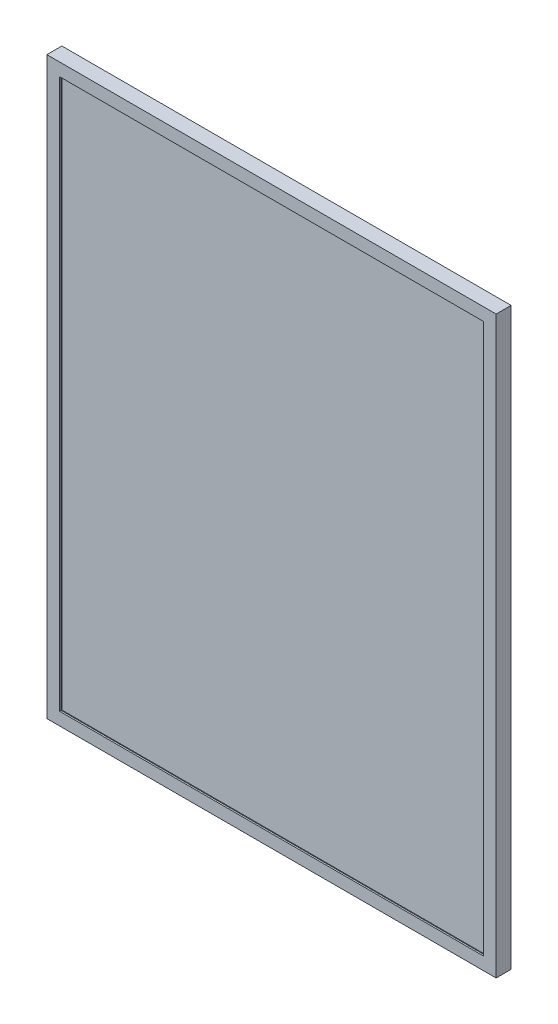
ISO-10303-21;
HEADER;
FILE_DESCRIPTION(('STEP AP214'),'2;1');
FILE_NAME('part.step','',(''),(''),'','','');
FILE_SCHEMA(('AUTOMOTIVE_DESIGN { 1 0 10303 214 1 1 1 1 }'));
ENDSEC;
DATA;
#1=APPLICATION_CONTEXT('core data for automotive mechanical design processes');
#2=APPLICATION_PROTOCOL_DEFINITION('international standard','automotive_design',2000,#1);
#3=PRODUCT_CONTEXT('',#1,'mechanical');
#4=PRODUCT('Part','Part','',(#3));
#5=PRODUCT_RELATED_PRODUCT_CATEGORY('part','',(#4));
#6=PRODUCT_DEFINITION_FORMATION('','',#4);
#7=PRODUCT_DEFINITION_CONTEXT('part definition',#1,'design');
#8=PRODUCT_DEFINITION('design','',#6,#7);
#9=PRODUCT_DEFINITION_SHAPE('','',#8);
#10=(LENGTH_UNIT() NAMED_UNIT(*) SI_UNIT(.MILLI.,.METRE.));
#11=(NAMED_UNIT(*) PLANE_ANGLE_UNIT() SI_UNIT($,.RADIAN.));
#12=(NAMED_UNIT(*) SI_UNIT($,.STERADIAN.) SOLID_ANGLE_UNIT());
#13=UNCERTAINTY_MEASURE_WITH_UNIT(LENGTH_MEASURE(1.E-05),#10,'distance_accuracy_value','');
#14=(GEOMETRIC_REPRESENTATION_CONTEXT(3) GLOBAL_UNCERTAINTY_ASSIGNED_CONTEXT((#13)) GLOBAL_UNIT_ASSIGNED_CONTEXT((#10,
#11,#12)) REPRESENTATION_CONTEXT('',''));
#15=CARTESIAN_POINT('',(0.,0.,0.));
#16=DIRECTION('',(0.,0.,1.));
#17=DIRECTION('',(1.,0.,0.));
#18=AXIS2_PLACEMENT_3D('',#15,#16,#17);
#19=CARTESIAN_POINT('',(-300.,-384.,20.));
#20=DIRECTION('',(1.,0.,0.));
#21=DIRECTION('',(0.,0.,-1.));
#22=AXIS2_PLACEMENT_3D('',#19,#20,#21);
#23=PLANE('',#22);
#24=DIRECTION('',(0.,-1.,0.));
#25=VECTOR('',#24,1.);
#26=CARTESIAN_POINT('',(-300.,-384.,0.));
#27=LINE('',#26,#25);
#28=CARTESIAN_POINT('',(-300.,384.,0.));
#29=VERTEX_POINT('',#28);
#30=CARTESIAN_POINT('',(-300.,-384.,0.));
#31=VERTEX_POINT('',#30);
#32=EDGE_CURVE('E212',#29,#31,#27,.T.);
#33=ORIENTED_EDGE('',*,*,#32,.T.);
#34=DIRECTION('',(0.,0.,-1.));
#35=VECTOR('',#34,1.);
#36=CARTESIAN_POINT('',(-300.,-384.,20.));
#37=LINE('',#36,#35);
#38=CARTESIAN_POINT('',(-300.,-384.,20.));
#39=VERTEX_POINT('',#38);
#40=EDGE_CURVE('E11',#39,#31,#37,.T.);
#41=ORIENTED_EDGE('',*,*,#40,.F.);
#42=DIRECTION('',(0.,-1.,0.));
#43=VECTOR('',#42,1.);
#44=CARTESIAN_POINT('',(-300.,-384.,20.));
#45=LINE('',#44,#43);
#46=CARTESIAN_POINT('',(-300.,384.,20.));
#47=VERTEX_POINT('',#46);
#48=EDGE_CURVE('E233',#47,#39,#45,.T.);
#49=ORIENTED_EDGE('',*,*,#48,.F.);
#50=DIRECTION('',(0.,0.,-1.));
#51=VECTOR('',#50,1.);
#52=CARTESIAN_POINT('',(-300.,384.,20.));
#53=LINE('',#52,#51);
#54=EDGE_CURVE('E243',#47,#29,#53,.T.);
#55=ORIENTED_EDGE('',*,*,#54,.T.);
#56=EDGE_LOOP('',(#33,#41,#49,#55));
#57=FACE_BOUND('',#56,.T.);
#58=ADVANCED_FACE('F39',(#57),#23,.F.);
#59=CARTESIAN_POINT('',(300.,-384.,20.));
#60=DIRECTION('',(0.,1.,0.));
#61=DIRECTION('',(-1.,0.,0.));
#62=AXIS2_PLACEMENT_3D('',#59,#60,#61);
#63=PLANE('',#62);
#64=DIRECTION('',(1.,0.,0.));
#65=VECTOR('',#64,1.);
#66=CARTESIAN_POINT('',(300.,-384.,0.));
#67=LINE('',#66,#65);
#68=CARTESIAN_POINT('',(300.,-384.,0.));
#69=VERTEX_POINT('',#68);
#70=EDGE_CURVE('E247',#31,#69,#67,.T.);
#71=ORIENTED_EDGE('',*,*,#70,.T.);
#72=DIRECTION('',(0.,0.,-1.));
#73=VECTOR('',#72,1.);
#74=CARTESIAN_POINT('',(300.,-384.,20.));
#75=LINE('',#74,#73);
#76=CARTESIAN_POINT('',(300.,-384.,20.));
#77=VERTEX_POINT('',#76);
#78=EDGE_CURVE('E47',#77,#69,#75,.T.);
#79=ORIENTED_EDGE('',*,*,#78,.F.);
#80=DIRECTION('',(1.,0.,0.));
#81=VECTOR('',#80,1.);
#82=CARTESIAN_POINT('',(300.,-384.,20.));
#83=LINE('',#82,#81);
#84=EDGE_CURVE('E91',#39,#77,#83,.T.);
#85=ORIENTED_EDGE('',*,*,#84,.F.);
#86=ORIENTED_EDGE('',*,*,#40,.T.);
#87=EDGE_LOOP('',(#71,#79,#85,#86));
#88=FACE_BOUND('',#87,.T.);
#89=ADVANCED_FACE('F281',(#88),#63,.F.);
#90=CARTESIAN_POINT('',(300.,-384.,20.));
#91=DIRECTION('',(-1.,0.,0.));
#92=DIRECTION('',(0.,0.,1.));
#93=AXIS2_PLACEMENT_3D('',#90,#91,#92);
#94=PLANE('',#93);
#95=DIRECTION('',(0.,1.,0.));
#96=VECTOR('',#95,1.);
#97=CARTESIAN_POINT('',(300.,-384.,0.));
#98=LINE('',#97,#96);
#99=CARTESIAN_POINT('',(300.,384.,0.));
#100=VERTEX_POINT('',#99);
#101=EDGE_CURVE('E250',#69,#100,#98,.T.);
#102=ORIENTED_EDGE('',*,*,#101,.T.);
#103=DIRECTION('',(0.,0.,-1.));
#104=VECTOR('',#103,1.);
#105=CARTESIAN_POINT('',(300.,384.,20.));
#106=LINE('',#105,#104);
#107=CARTESIAN_POINT('',(300.,384.,20.));
#108=VERTEX_POINT('',#107);
#109=EDGE_CURVE('E257',#108,#100,#106,.T.);
#110=ORIENTED_EDGE('',*,*,#109,.F.);
#111=DIRECTION('',(0.,1.,0.));
#112=VECTOR('',#111,1.);
#113=CARTESIAN_POINT('',(300.,-384.,20.));
#114=LINE('',#113,#112);
#115=EDGE_CURVE('E238',#77,#108,#114,.T.);
#116=ORIENTED_EDGE('',*,*,#115,.F.);
#117=ORIENTED_EDGE('',*,*,#78,.T.);
#118=EDGE_LOOP('',(#102,#110,#116,#117));
#119=FACE_BOUND('',#118,.T.);
#120=ADVANCED_FACE('F264',(#119),#94,.F.);
#121=CARTESIAN_POINT('',(300.,384.,20.));
#122=DIRECTION('',(0.,-1.,0.));
#123=DIRECTION('',(1.,0.,0.));
#124=AXIS2_PLACEMENT_3D('',#121,#122,#123);
#125=PLANE('',#124);
#126=DIRECTION('',(-1.,0.,0.));
#127=VECTOR('',#126,1.);
#128=CARTESIAN_POINT('',(300.,384.,0.));
#129=LINE('',#128,#127);
#130=EDGE_CURVE('E84',#100,#29,#129,.T.);
#131=ORIENTED_EDGE('',*,*,#130,.T.);
#132=ORIENTED_EDGE('',*,*,#54,.F.);
#133=DIRECTION('',(-1.,0.,0.));
#134=VECTOR('',#133,1.);
#135=CARTESIAN_POINT('',(300.,384.,20.));
#136=LINE('',#135,#134);
#137=EDGE_CURVE('E63',#108,#47,#136,.T.);
#138=ORIENTED_EDGE('',*,*,#137,.F.);
#139=ORIENTED_EDGE('',*,*,#109,.T.);
#140=EDGE_LOOP('',(#131,#132,#138,#139));
#141=FACE_BOUND('',#140,.T.);
#142=ADVANCED_FACE('F272',(#141),#125,.F.);
#143=CARTESIAN_POINT('',(0.,0.,20.));
#144=DIRECTION('',(0.,0.,1.));
#145=DIRECTION('',(1.,0.,0.));
#146=AXIS2_PLACEMENT_3D('',#143,#144,#145);
#147=PLANE('',#146);
#148=ORIENTED_EDGE('',*,*,#48,.T.);
#149=ORIENTED_EDGE('',*,*,#84,.T.);
#150=ORIENTED_EDGE('',*,*,#115,.T.);
#151=ORIENTED_EDGE('',*,*,#137,.T.);
#152=EDGE_LOOP('',(#148,#149,#150,#151));
#153=FACE_BOUND('',#152,.T.);
#154=DIRECTION('',(0.,-1.,0.));
#155=VECTOR('',#154,1.);
#156=CARTESIAN_POINT('',(-283.,367.,20.));
#157=LINE('',#156,#155);
#158=CARTESIAN_POINT('',(-283.,367.,20.));
#159=VERTEX_POINT('',#158);
#160=CARTESIAN_POINT('',(-283.,-367.,20.));
#161=VERTEX_POINT('',#160);
#162=EDGE_CURVE('E144',#159,#161,#157,.T.);
#163=ORIENTED_EDGE('',*,*,#162,.F.);
#164=DIRECTION('',(-1.,0.,0.));
#165=VECTOR('',#164,1.);
#166=CARTESIAN_POINT('',(-283.,367.,20.));
#167=LINE('',#166,#165);
#168=CARTESIAN_POINT('',(283.,367.,20.));
#169=VERTEX_POINT('',#168);
#170=EDGE_CURVE('E164',#169,#159,#167,.T.);
#171=ORIENTED_EDGE('',*,*,#170,.F.);
#172=DIRECTION('',(0.,1.,0.));
#173=VECTOR('',#172,1.);
#174=CARTESIAN_POINT('',(283.,367.,20.));
#175=LINE('',#174,#173);
#176=CARTESIAN_POINT('',(283.,-367.,20.));
#177=VERTEX_POINT('',#176);
#178=EDGE_CURVE('E168',#177,#169,#175,.T.);
#179=ORIENTED_EDGE('',*,*,#178,.F.);
#180=DIRECTION('',(1.,0.,0.));
#181=VECTOR('',#180,1.);
#182=CARTESIAN_POINT('',(-283.,-367.,20.));
#183=LINE('',#182,#181);
#184=EDGE_CURVE('E177',#161,#177,#183,.T.);
#185=ORIENTED_EDGE('',*,*,#184,.F.);
#186=EDGE_LOOP('',(#163,#171,#179,#185));
#187=FACE_BOUND('',#186,.T.);
#188=ADVANCED_FACE('F274',(#153,#187),#147,.T.);
#189=CARTESIAN_POINT('',(0.,0.,0.));
#190=DIRECTION('',(0.,0.,1.));
#191=DIRECTION('',(1.,0.,0.));
#192=AXIS2_PLACEMENT_3D('',#189,#190,#191);
#193=PLANE('',#192);
#194=ORIENTED_EDGE('',*,*,#32,.F.);
#195=ORIENTED_EDGE('',*,*,#130,.F.);
#196=ORIENTED_EDGE('',*,*,#101,.F.);
#197=ORIENTED_EDGE('',*,*,#70,.F.);
#198=EDGE_LOOP('',(#194,#195,#196,#197));
#199=FACE_BOUND('',#198,.T.);
#200=ADVANCED_FACE('F268',(#199),#193,.F.);
#201=CARTESIAN_POINT('',(0.,0.,18.));
#202=DIRECTION('',(0.,0.,1.));
#203=DIRECTION('',(1.,0.,0.));
#204=AXIS2_PLACEMENT_3D('',#201,#202,#203);
#205=PLANE('',#204);
#206=DIRECTION('',(-1.,0.,0.));
#207=VECTOR('',#206,1.);
#208=CARTESIAN_POINT('',(-283.,367.,18.));
#209=LINE('',#208,#207);
#210=CARTESIAN_POINT('',(283.,367.,18.));
#211=VERTEX_POINT('',#210);
#212=CARTESIAN_POINT('',(-283.,367.,18.));
#213=VERTEX_POINT('',#212);
#214=EDGE_CURVE('E150',#211,#213,#209,.T.);
#215=ORIENTED_EDGE('',*,*,#214,.T.);
#216=DIRECTION('',(0.,-1.,0.));
#217=VECTOR('',#216,1.);
#218=CARTESIAN_POINT('',(-283.,367.,18.));
#219=LINE('',#218,#217);
#220=CARTESIAN_POINT('',(-283.,-367.,18.));
#221=VERTEX_POINT('',#220);
#222=EDGE_CURVE('E141',#213,#221,#219,.T.);
#223=ORIENTED_EDGE('',*,*,#222,.T.);
#224=DIRECTION('',(1.,0.,0.));
#225=VECTOR('',#224,1.);
#226=CARTESIAN_POINT('',(-283.,-367.,18.));
#227=LINE('',#226,#225);
#228=CARTESIAN_POINT('',(283.,-367.,18.));
#229=VERTEX_POINT('',#228);
#230=EDGE_CURVE('E154',#221,#229,#227,.T.);
#231=ORIENTED_EDGE('',*,*,#230,.T.);
#232=DIRECTION('',(0.,1.,0.));
#233=VECTOR('',#232,1.);
#234=CARTESIAN_POINT('',(283.,367.,18.));
#235=LINE('',#234,#233);
#236=EDGE_CURVE('E159',#229,#211,#235,.T.);
#237=ORIENTED_EDGE('',*,*,#236,.T.);
#238=EDGE_LOOP('',(#215,#223,#231,#237));
#239=FACE_BOUND('',#238,.T.);
#240=DIRECTION('',(0.,-1.,0.));
#241=VECTOR('',#240,1.);
#242=CARTESIAN_POINT('',(-298.,382.,18.));
#243=LINE('',#242,#241);
#244=CARTESIAN_POINT('',(-298.,382.,18.));
#245=VERTEX_POINT('',#244);
#246=CARTESIAN_POINT('',(-298.,-382.,18.));
#247=VERTEX_POINT('',#246);
#248=EDGE_CURVE('E54',#245,#247,#243,.T.);
#249=ORIENTED_EDGE('',*,*,#248,.F.);
#250=DIRECTION('',(-1.,0.,0.));
#251=VECTOR('',#250,1.);
#252=CARTESIAN_POINT('',(-298.,382.,18.));
#253=LINE('',#252,#251);
#254=CARTESIAN_POINT('',(298.,382.,18.));
#255=VERTEX_POINT('',#254);
#256=EDGE_CURVE('E201',#255,#245,#253,.T.);
#257=ORIENTED_EDGE('',*,*,#256,.F.);
#258=DIRECTION('',(0.,1.,0.));
#259=VECTOR('',#258,1.);
#260=CARTESIAN_POINT('',(298.,382.,18.));
#261=LINE('',#260,#259);
#262=CARTESIAN_POINT('',(298.,-382.,18.));
#263=VERTEX_POINT('',#262);
#264=EDGE_CURVE('E197',#263,#255,#261,.T.);
#265=ORIENTED_EDGE('',*,*,#264,.F.);
#266=DIRECTION('',(1.,0.,0.));
#267=VECTOR('',#266,1.);
#268=CARTESIAN_POINT('',(-298.,-382.,18.));
#269=LINE('',#268,#267);
#270=EDGE_CURVE('E193',#247,#263,#269,.T.);
#271=ORIENTED_EDGE('',*,*,#270,.F.);
#272=EDGE_LOOP('',(#249,#257,#265,#271));
#273=FACE_BOUND('',#272,.T.);
#274=ADVANCED_FACE('F161',(#239,#273),#205,.F.);
#275=CARTESIAN_POINT('',(-283.,367.,18.));
#276=DIRECTION('',(-1.,0.,0.));
#277=DIRECTION('',(0.,-1.,0.));
#278=AXIS2_PLACEMENT_3D('',#275,#276,#277);
#279=PLANE('',#278);
#280=ORIENTED_EDGE('',*,*,#162,.T.);
#281=DIRECTION('',(0.,0.,1.));
#282=VECTOR('',#281,1.);
#283=CARTESIAN_POINT('',(-283.,-367.,18.));
#284=LINE('',#283,#282);
#285=EDGE_CURVE('E137',#221,#161,#284,.T.);
#286=ORIENTED_EDGE('',*,*,#285,.F.);
#287=ORIENTED_EDGE('',*,*,#222,.F.);
#288=DIRECTION('',(0.,0.,1.));
#289=VECTOR('',#288,1.);
#290=CARTESIAN_POINT('',(-283.,367.,18.));
#291=LINE('',#290,#289);
#292=EDGE_CURVE('E183',#213,#159,#291,.T.);
#293=ORIENTED_EDGE('',*,*,#292,.T.);
#294=EDGE_LOOP('',(#280,#286,#287,#293));
#295=FACE_BOUND('',#294,.T.);
#296=ADVANCED_FACE('F139',(#295),#279,.F.);
#297=CARTESIAN_POINT('',(-283.,367.,18.));
#298=DIRECTION('',(0.,1.,0.));
#299=DIRECTION('',(0.,0.,1.));
#300=AXIS2_PLACEMENT_3D('',#297,#298,#299);
#301=PLANE('',#300);
#302=ORIENTED_EDGE('',*,*,#170,.T.);
#303=ORIENTED_EDGE('',*,*,#292,.F.);
#304=ORIENTED_EDGE('',*,*,#214,.F.);
#305=DIRECTION('',(0.,0.,1.));
#306=VECTOR('',#305,1.);
#307=CARTESIAN_POINT('',(283.,367.,18.));
#308=LINE('',#307,#306);
#309=EDGE_CURVE('E186',#211,#169,#308,.T.);
#310=ORIENTED_EDGE('',*,*,#309,.T.);
#311=EDGE_LOOP('',(#302,#303,#304,#310));
#312=FACE_BOUND('',#311,.T.);
#313=ADVANCED_FACE('F344',(#312),#301,.F.);
#314=CARTESIAN_POINT('',(283.,367.,18.));
#315=DIRECTION('',(1.,0.,0.));
#316=DIRECTION('',(0.,1.,0.));
#317=AXIS2_PLACEMENT_3D('',#314,#315,#316);
#318=PLANE('',#317);
#319=ORIENTED_EDGE('',*,*,#178,.T.);
#320=ORIENTED_EDGE('',*,*,#309,.F.);
#321=ORIENTED_EDGE('',*,*,#236,.F.);
#322=DIRECTION('',(0.,0.,1.));
#323=VECTOR('',#322,1.);
#324=CARTESIAN_POINT('',(283.,-367.,18.));
#325=LINE('',#324,#323);
#326=EDGE_CURVE('E149',#229,#177,#325,.T.);
#327=ORIENTED_EDGE('',*,*,#326,.T.);
#328=EDGE_LOOP('',(#319,#320,#321,#327));
#329=FACE_BOUND('',#328,.T.);
#330=ADVANCED_FACE('F353',(#329),#318,.F.);
#331=CARTESIAN_POINT('',(-283.,-367.,18.));
#332=DIRECTION('',(0.,-1.,0.));
#333=DIRECTION('',(0.,0.,-1.));
#334=AXIS2_PLACEMENT_3D('',#331,#332,#333);
#335=PLANE('',#334);
#336=ORIENTED_EDGE('',*,*,#184,.T.);
#337=ORIENTED_EDGE('',*,*,#326,.F.);
#338=ORIENTED_EDGE('',*,*,#230,.F.);
#339=ORIENTED_EDGE('',*,*,#285,.T.);
#340=EDGE_LOOP('',(#336,#337,#338,#339));
#341=FACE_BOUND('',#340,.T.);
#342=ADVANCED_FACE('F155',(#341),#335,.F.);
#343=CARTESIAN_POINT('',(0.,0.,2.));
#344=DIRECTION('',(0.,0.,1.));
#345=DIRECTION('',(1.,0.,0.));
#346=AXIS2_PLACEMENT_3D('',#343,#344,#345);
#347=PLANE('',#346);
#348=DIRECTION('',(0.,-1.,0.));
#349=VECTOR('',#348,1.);
#350=CARTESIAN_POINT('',(-298.,-384.,2.));
#351=LINE('',#350,#349);
#352=CARTESIAN_POINT('',(-298.,382.,2.));
#353=VERTEX_POINT('',#352);
#354=CARTESIAN_POINT('',(-298.,-382.,2.));
#355=VERTEX_POINT('',#354);
#356=EDGE_CURVE('E204',#353,#355,#351,.T.);
#357=ORIENTED_EDGE('',*,*,#356,.T.);
#358=DIRECTION('',(1.,0.,0.));
#359=VECTOR('',#358,1.);
#360=CARTESIAN_POINT('',(300.,-382.,2.));
#361=LINE('',#360,#359);
#362=CARTESIAN_POINT('',(298.,-382.,2.));
#363=VERTEX_POINT('',#362);
#364=EDGE_CURVE('E208',#355,#363,#361,.T.);
#365=ORIENTED_EDGE('',*,*,#364,.T.);
#366=DIRECTION('',(0.,1.,0.));
#367=VECTOR('',#366,1.);
#368=CARTESIAN_POINT('',(298.,-384.,2.));
#369=LINE('',#368,#367);
#370=CARTESIAN_POINT('',(298.,382.,2.));
#371=VERTEX_POINT('',#370);
#372=EDGE_CURVE('E222',#363,#371,#369,.T.);
#373=ORIENTED_EDGE('',*,*,#372,.T.);
#374=DIRECTION('',(-1.,0.,0.));
#375=VECTOR('',#374,1.);
#376=CARTESIAN_POINT('',(300.,382.,2.));
#377=LINE('',#376,#375);
#378=EDGE_CURVE('E218',#371,#353,#377,.T.);
#379=ORIENTED_EDGE('',*,*,#378,.T.);
#380=EDGE_LOOP('',(#357,#365,#373,#379));
#381=FACE_BOUND('',#380,.T.);
#382=ADVANCED_FACE('F313',(#381),#347,.T.);
#383=CARTESIAN_POINT('',(300.,382.,20.));
#384=DIRECTION('',(0.,-1.,0.));
#385=DIRECTION('',(1.,0.,0.));
#386=AXIS2_PLACEMENT_3D('',#383,#384,#385);
#387=PLANE('',#386);
#388=DIRECTION('',(0.,0.,-1.));
#389=VECTOR('',#388,1.);
#390=CARTESIAN_POINT('',(298.,382.,20.));
#391=LINE('',#390,#389);
#392=EDGE_CURVE('E217',#255,#371,#391,.T.);
#393=ORIENTED_EDGE('',*,*,#392,.F.);
#394=ORIENTED_EDGE('',*,*,#256,.T.);
#395=DIRECTION('',(0.,0.,-1.));
#396=VECTOR('',#395,1.);
#397=CARTESIAN_POINT('',(-298.,382.,20.));
#398=LINE('',#397,#396);
#399=EDGE_CURVE('E214',#245,#353,#398,.T.);
#400=ORIENTED_EDGE('',*,*,#399,.T.);
#401=ORIENTED_EDGE('',*,*,#378,.F.);
#402=EDGE_LOOP('',(#393,#394,#400,#401));
#403=FACE_BOUND('',#402,.T.);
#404=ADVANCED_FACE('F317',(#403),#387,.T.);
#405=CARTESIAN_POINT('',(298.,-384.,20.));
#406=DIRECTION('',(-1.,0.,0.));
#407=DIRECTION('',(0.,0.,1.));
#408=AXIS2_PLACEMENT_3D('',#405,#406,#407);
#409=PLANE('',#408);
#410=DIRECTION('',(0.,0.,-1.));
#411=VECTOR('',#410,1.);
#412=CARTESIAN_POINT('',(298.,-382.,20.));
#413=LINE('',#412,#411);
#414=EDGE_CURVE('E213',#263,#363,#413,.T.);
#415=ORIENTED_EDGE('',*,*,#414,.F.);
#416=ORIENTED_EDGE('',*,*,#264,.T.);
#417=ORIENTED_EDGE('',*,*,#392,.T.);
#418=ORIENTED_EDGE('',*,*,#372,.F.);
#419=EDGE_LOOP('',(#415,#416,#417,#418));
#420=FACE_BOUND('',#419,.T.);
#421=ADVANCED_FACE('F377',(#420),#409,.T.);
#422=CARTESIAN_POINT('',(300.,-382.,20.));
#423=DIRECTION('',(0.,1.,0.));
#424=DIRECTION('',(-1.,0.,0.));
#425=AXIS2_PLACEMENT_3D('',#422,#423,#424);
#426=PLANE('',#425);
#427=DIRECTION('',(0.,0.,-1.));
#428=VECTOR('',#427,1.);
#429=CARTESIAN_POINT('',(-298.,-382.,20.));
#430=LINE('',#429,#428);
#431=EDGE_CURVE('E209',#247,#355,#430,.T.);
#432=ORIENTED_EDGE('',*,*,#431,.F.);
#433=ORIENTED_EDGE('',*,*,#270,.T.);
#434=ORIENTED_EDGE('',*,*,#414,.T.);
#435=ORIENTED_EDGE('',*,*,#364,.F.);
#436=EDGE_LOOP('',(#432,#433,#434,#435));
#437=FACE_BOUND('',#436,.T.);
#438=ADVANCED_FACE('F387',(#437),#426,.T.);
#439=CARTESIAN_POINT('',(-298.,-384.,20.));
#440=DIRECTION('',(1.,0.,0.));
#441=DIRECTION('',(0.,0.,-1.));
#442=AXIS2_PLACEMENT_3D('',#439,#440,#441);
#443=PLANE('',#442);
#444=ORIENTED_EDGE('',*,*,#399,.F.);
#445=ORIENTED_EDGE('',*,*,#248,.T.);
#446=ORIENTED_EDGE('',*,*,#431,.T.);
#447=ORIENTED_EDGE('',*,*,#356,.F.);
#448=EDGE_LOOP('',(#444,#445,#446,#447));
#449=FACE_BOUND('',#448,.T.);
#450=ADVANCED_FACE('F397',(#449),#443,.T.);
#451=CLOSED_SHELL('',(#58,#89,#120,#142,#188,#200,#274,#296,#313,#330,#342,#382,#404,#421,#438,#450));
#452=MANIFOLD_SOLID_BREP('B2',#451);
#453=ADVANCED_BREP_SHAPE_REPRESENTATION('',(#18,#452),#14);
#454=SHAPE_DEFINITION_REPRESENTATION(#9,#453);
ENDSEC;
END-ISO-10303-21;
